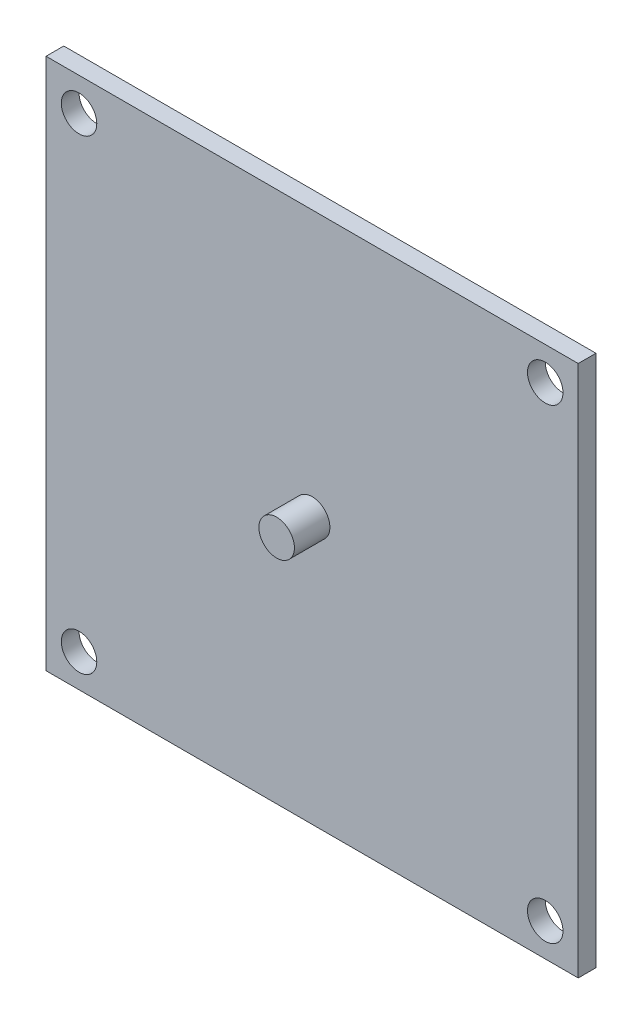
ISO-10303-21;
HEADER;
FILE_DESCRIPTION(('STEP AP214'),'2;1');
FILE_NAME('part.step','',(''),(''),'','','');
FILE_SCHEMA(('AUTOMOTIVE_DESIGN { 1 0 10303 214 1 1 1 1 }'));
ENDSEC;
DATA;
#1=APPLICATION_CONTEXT('core data for automotive mechanical design processes');
#2=APPLICATION_PROTOCOL_DEFINITION('international standard','automotive_design',2000,#1);
#3=PRODUCT_CONTEXT('',#1,'mechanical');
#4=PRODUCT('Part','Part','',(#3));
#5=PRODUCT_RELATED_PRODUCT_CATEGORY('part','',(#4));
#6=PRODUCT_DEFINITION_FORMATION('','',#4);
#7=PRODUCT_DEFINITION_CONTEXT('part definition',#1,'design');
#8=PRODUCT_DEFINITION('design','',#6,#7);
#9=PRODUCT_DEFINITION_SHAPE('','',#8);
#10=(LENGTH_UNIT() NAMED_UNIT(*) SI_UNIT(.MILLI.,.METRE.));
#11=(NAMED_UNIT(*) PLANE_ANGLE_UNIT() SI_UNIT($,.RADIAN.));
#12=(NAMED_UNIT(*) SI_UNIT($,.STERADIAN.) SOLID_ANGLE_UNIT());
#13=UNCERTAINTY_MEASURE_WITH_UNIT(LENGTH_MEASURE(1.E-05),#10,'distance_accuracy_value','');
#14=(GEOMETRIC_REPRESENTATION_CONTEXT(3) GLOBAL_UNCERTAINTY_ASSIGNED_CONTEXT((#13)) GLOBAL_UNIT_ASSIGNED_CONTEXT((#10,
#11,#12)) REPRESENTATION_CONTEXT('',''));
#15=CARTESIAN_POINT('',(0.,0.,0.));
#16=DIRECTION('',(0.,0.,1.));
#17=DIRECTION('',(1.,0.,0.));
#18=AXIS2_PLACEMENT_3D('',#15,#16,#17);
#19=CARTESIAN_POINT('',(15.,15.,1.));
#20=DIRECTION('',(-1.,0.,0.));
#21=DIRECTION('',(0.,-1.,0.));
#22=AXIS2_PLACEMENT_3D('',#19,#20,#21);
#23=PLANE('',#22);
#24=DIRECTION('',(0.,1.,0.));
#25=VECTOR('',#24,1.);
#26=CARTESIAN_POINT('',(15.,15.,0.));
#27=LINE('',#26,#25);
#28=CARTESIAN_POINT('',(15.,-15.,0.));
#29=VERTEX_POINT('',#28);
#30=CARTESIAN_POINT('',(15.,15.,0.));
#31=VERTEX_POINT('',#30);
#32=EDGE_CURVE('E95',#29,#31,#27,.T.);
#33=ORIENTED_EDGE('',*,*,#32,.T.);
#34=DIRECTION('',(0.,0.,-1.));
#35=VECTOR('',#34,1.);
#36=CARTESIAN_POINT('',(15.,15.,1.));
#37=LINE('',#36,#35);
#38=CARTESIAN_POINT('',(15.,15.,1.));
#39=VERTEX_POINT('',#38);
#40=EDGE_CURVE('E11',#39,#31,#37,.T.);
#41=ORIENTED_EDGE('',*,*,#40,.F.);
#42=DIRECTION('',(0.,1.,0.));
#43=VECTOR('',#42,1.);
#44=CARTESIAN_POINT('',(15.,15.,1.));
#45=LINE('',#44,#43);
#46=CARTESIAN_POINT('',(15.,-15.,1.));
#47=VERTEX_POINT('',#46);
#48=EDGE_CURVE('E83',#47,#39,#45,.T.);
#49=ORIENTED_EDGE('',*,*,#48,.F.);
#50=DIRECTION('',(0.,0.,-1.));
#51=VECTOR('',#50,1.);
#52=CARTESIAN_POINT('',(15.,-15.,1.));
#53=LINE('',#52,#51);
#54=EDGE_CURVE('E91',#47,#29,#53,.T.);
#55=ORIENTED_EDGE('',*,*,#54,.T.);
#56=EDGE_LOOP('',(#33,#41,#49,#55));
#57=FACE_BOUND('',#56,.T.);
#58=ADVANCED_FACE('F32',(#57),#23,.F.);
#59=CARTESIAN_POINT('',(-15.,15.,1.));
#60=DIRECTION('',(0.,-1.,0.));
#61=DIRECTION('',(0.,0.,-1.));
#62=AXIS2_PLACEMENT_3D('',#59,#60,#61);
#63=PLANE('',#62);
#64=DIRECTION('',(-1.,0.,0.));
#65=VECTOR('',#64,1.);
#66=CARTESIAN_POINT('',(-15.,15.,0.));
#67=LINE('',#66,#65);
#68=CARTESIAN_POINT('',(-15.,15.,0.));
#69=VERTEX_POINT('',#68);
#70=EDGE_CURVE('E87',#31,#69,#67,.T.);
#71=ORIENTED_EDGE('',*,*,#70,.T.);
#72=DIRECTION('',(0.,0.,-1.));
#73=VECTOR('',#72,1.);
#74=CARTESIAN_POINT('',(-15.,15.,1.));
#75=LINE('',#74,#73);
#76=CARTESIAN_POINT('',(-15.,15.,1.));
#77=VERTEX_POINT('',#76);
#78=EDGE_CURVE('E40',#77,#69,#75,.T.);
#79=ORIENTED_EDGE('',*,*,#78,.F.);
#80=DIRECTION('',(-1.,0.,0.));
#81=VECTOR('',#80,1.);
#82=CARTESIAN_POINT('',(-15.,15.,1.));
#83=LINE('',#82,#81);
#84=EDGE_CURVE('E78',#39,#77,#83,.T.);
#85=ORIENTED_EDGE('',*,*,#84,.F.);
#86=ORIENTED_EDGE('',*,*,#40,.T.);
#87=EDGE_LOOP('',(#71,#79,#85,#86));
#88=FACE_BOUND('',#87,.T.);
#89=ADVANCED_FACE('F86',(#88),#63,.F.);
#90=CARTESIAN_POINT('',(-15.,15.,1.));
#91=DIRECTION('',(1.,0.,0.));
#92=DIRECTION('',(0.,1.,0.));
#93=AXIS2_PLACEMENT_3D('',#90,#91,#92);
#94=PLANE('',#93);
#95=DIRECTION('',(0.,-1.,0.));
#96=VECTOR('',#95,1.);
#97=CARTESIAN_POINT('',(-15.,15.,0.));
#98=LINE('',#97,#96);
#99=CARTESIAN_POINT('',(-15.,-15.,0.));
#100=VERTEX_POINT('',#99);
#101=EDGE_CURVE('E65',#69,#100,#98,.T.);
#102=ORIENTED_EDGE('',*,*,#101,.T.);
#103=DIRECTION('',(0.,0.,-1.));
#104=VECTOR('',#103,1.);
#105=CARTESIAN_POINT('',(-15.,-15.,1.));
#106=LINE('',#105,#104);
#107=CARTESIAN_POINT('',(-15.,-15.,1.));
#108=VERTEX_POINT('',#107);
#109=EDGE_CURVE('E88',#108,#100,#106,.T.);
#110=ORIENTED_EDGE('',*,*,#109,.F.);
#111=DIRECTION('',(0.,-1.,0.));
#112=VECTOR('',#111,1.);
#113=CARTESIAN_POINT('',(-15.,15.,1.));
#114=LINE('',#113,#112);
#115=EDGE_CURVE('E81',#77,#108,#114,.T.);
#116=ORIENTED_EDGE('',*,*,#115,.F.);
#117=ORIENTED_EDGE('',*,*,#78,.T.);
#118=EDGE_LOOP('',(#102,#110,#116,#117));
#119=FACE_BOUND('',#118,.T.);
#120=ADVANCED_FACE('F89',(#119),#94,.F.);
#121=CARTESIAN_POINT('',(-15.,-15.,1.));
#122=DIRECTION('',(0.,1.,0.));
#123=DIRECTION('',(0.,0.,1.));
#124=AXIS2_PLACEMENT_3D('',#121,#122,#123);
#125=PLANE('',#124);
#126=DIRECTION('',(1.,0.,0.));
#127=VECTOR('',#126,1.);
#128=CARTESIAN_POINT('',(-15.,-15.,0.));
#129=LINE('',#128,#127);
#130=EDGE_CURVE('E71',#100,#29,#129,.T.);
#131=ORIENTED_EDGE('',*,*,#130,.T.);
#132=ORIENTED_EDGE('',*,*,#54,.F.);
#133=DIRECTION('',(1.,0.,0.));
#134=VECTOR('',#133,1.);
#135=CARTESIAN_POINT('',(-15.,-15.,1.));
#136=LINE('',#135,#134);
#137=EDGE_CURVE('E48',#108,#47,#136,.T.);
#138=ORIENTED_EDGE('',*,*,#137,.F.);
#139=ORIENTED_EDGE('',*,*,#109,.T.);
#140=EDGE_LOOP('',(#131,#132,#138,#139));
#141=FACE_BOUND('',#140,.T.);
#142=ADVANCED_FACE('F103',(#141),#125,.F.);
#143=CARTESIAN_POINT('',(0.,0.,1.));
#144=DIRECTION('',(0.,0.,1.));
#145=DIRECTION('',(1.,0.,0.));
#146=AXIS2_PLACEMENT_3D('',#143,#144,#145);
#147=PLANE('',#146);
#148=CARTESIAN_POINT('',(0.,0.,1.));
#149=DIRECTION('',(0.,0.,1.));
#150=DIRECTION('',(1.,0.,0.));
#151=AXIS2_PLACEMENT_3D('',#148,#149,#150);
#152=CIRCLE('',#151,1.);
#153=CARTESIAN_POINT('',(1.,0.,1.));
#154=VERTEX_POINT('',#153);
#155=EDGE_CURVE('E133',#154,#154,#152,.T.);
#156=ORIENTED_EDGE('',*,*,#155,.F.);
#157=EDGE_LOOP('',(#156));
#158=FACE_BOUND('',#157,.T.);
#159=CARTESIAN_POINT('',(-13.1399999999993,-13.14,1.));
#160=DIRECTION('',(0.,0.,1.));
#161=DIRECTION('',(1.,0.,0.));
#162=AXIS2_PLACEMENT_3D('',#159,#160,#161);
#163=CIRCLE('',#162,1.00000000000039);
#164=CARTESIAN_POINT('',(-12.1399999999989,-13.14,1.));
#165=VERTEX_POINT('',#164);
#166=EDGE_CURVE('E115',#165,#165,#163,.T.);
#167=ORIENTED_EDGE('',*,*,#166,.F.);
#168=EDGE_LOOP('',(#167));
#169=FACE_BOUND('',#168,.T.);
#170=CARTESIAN_POINT('',(13.1400000000007,-13.1399999999993,1.));
#171=DIRECTION('',(0.,0.,1.));
#172=DIRECTION('',(1.,0.,0.));
#173=AXIS2_PLACEMENT_3D('',#170,#171,#172);
#174=CIRCLE('',#173,1.00000000000104);
#175=CARTESIAN_POINT('',(14.1400000000018,-13.1399999999993,1.));
#176=VERTEX_POINT('',#175);
#177=EDGE_CURVE('E122',#176,#176,#174,.T.);
#178=ORIENTED_EDGE('',*,*,#177,.F.);
#179=EDGE_LOOP('',(#178));
#180=FACE_BOUND('',#179,.T.);
#181=CARTESIAN_POINT('',(13.14,13.1400000000007,1.));
#182=DIRECTION('',(0.,0.,1.));
#183=DIRECTION('',(1.,0.,0.));
#184=AXIS2_PLACEMENT_3D('',#181,#182,#183);
#185=CIRCLE('',#184,1.00000000000077);
#186=CARTESIAN_POINT('',(14.1400000000008,13.1400000000007,1.));
#187=VERTEX_POINT('',#186);
#188=EDGE_CURVE('E128',#187,#187,#185,.T.);
#189=ORIENTED_EDGE('',*,*,#188,.F.);
#190=EDGE_LOOP('',(#189));
#191=FACE_BOUND('',#190,.T.);
#192=CARTESIAN_POINT('',(-13.14,13.14,1.));
#193=DIRECTION('',(0.,0.,1.));
#194=DIRECTION('',(1.,0.,0.));
#195=AXIS2_PLACEMENT_3D('',#192,#193,#194);
#196=CIRCLE('',#195,1.);
#197=CARTESIAN_POINT('',(-12.14,13.14,1.));
#198=VERTEX_POINT('',#197);
#199=EDGE_CURVE('E109',#198,#198,#196,.T.);
#200=ORIENTED_EDGE('',*,*,#199,.F.);
#201=EDGE_LOOP('',(#200));
#202=FACE_BOUND('',#201,.T.);
#203=ORIENTED_EDGE('',*,*,#48,.T.);
#204=ORIENTED_EDGE('',*,*,#84,.T.);
#205=ORIENTED_EDGE('',*,*,#115,.T.);
#206=ORIENTED_EDGE('',*,*,#137,.T.);
#207=EDGE_LOOP('',(#203,#204,#205,#206));
#208=FACE_BOUND('',#207,.T.);
#209=ADVANCED_FACE('F79',(#158,#169,#180,#191,#202,#208),#147,.T.);
#210=CARTESIAN_POINT('',(0.,0.,0.));
#211=DIRECTION('',(0.,0.,1.));
#212=DIRECTION('',(1.,0.,0.));
#213=AXIS2_PLACEMENT_3D('',#210,#211,#212);
#214=PLANE('',#213);
#215=CARTESIAN_POINT('',(-13.1399999999993,-13.14,0.));
#216=DIRECTION('',(0.,0.,1.));
#217=DIRECTION('',(1.,0.,0.));
#218=AXIS2_PLACEMENT_3D('',#215,#216,#217);
#219=CIRCLE('',#218,1.00000000000039);
#220=CARTESIAN_POINT('',(-12.1399999999989,-13.14,0.));
#221=VERTEX_POINT('',#220);
#222=EDGE_CURVE('E118',#221,#221,#219,.T.);
#223=ORIENTED_EDGE('',*,*,#222,.T.);
#224=EDGE_LOOP('',(#223));
#225=FACE_BOUND('',#224,.T.);
#226=CARTESIAN_POINT('',(13.1400000000007,-13.1399999999993,0.));
#227=DIRECTION('',(0.,0.,1.));
#228=DIRECTION('',(1.,0.,0.));
#229=AXIS2_PLACEMENT_3D('',#226,#227,#228);
#230=CIRCLE('',#229,1.00000000000104);
#231=CARTESIAN_POINT('',(14.1400000000018,-13.1399999999993,0.));
#232=VERTEX_POINT('',#231);
#233=EDGE_CURVE('E125',#232,#232,#230,.T.);
#234=ORIENTED_EDGE('',*,*,#233,.T.);
#235=EDGE_LOOP('',(#234));
#236=FACE_BOUND('',#235,.T.);
#237=CARTESIAN_POINT('',(13.14,13.1400000000007,0.));
#238=DIRECTION('',(0.,0.,1.));
#239=DIRECTION('',(1.,0.,0.));
#240=AXIS2_PLACEMENT_3D('',#237,#238,#239);
#241=CIRCLE('',#240,1.00000000000077);
#242=CARTESIAN_POINT('',(14.1400000000008,13.1400000000007,0.));
#243=VERTEX_POINT('',#242);
#244=EDGE_CURVE('E112',#243,#243,#241,.T.);
#245=ORIENTED_EDGE('',*,*,#244,.T.);
#246=EDGE_LOOP('',(#245));
#247=FACE_BOUND('',#246,.T.);
#248=CARTESIAN_POINT('',(-13.14,13.14,0.));
#249=DIRECTION('',(0.,0.,1.));
#250=DIRECTION('',(1.,0.,0.));
#251=AXIS2_PLACEMENT_3D('',#248,#249,#250);
#252=CIRCLE('',#251,1.);
#253=CARTESIAN_POINT('',(-12.14,13.14,0.));
#254=VERTEX_POINT('',#253);
#255=EDGE_CURVE('E98',#254,#254,#252,.T.);
#256=ORIENTED_EDGE('',*,*,#255,.T.);
#257=EDGE_LOOP('',(#256));
#258=FACE_BOUND('',#257,.T.);
#259=ORIENTED_EDGE('',*,*,#32,.F.);
#260=ORIENTED_EDGE('',*,*,#130,.F.);
#261=ORIENTED_EDGE('',*,*,#101,.F.);
#262=ORIENTED_EDGE('',*,*,#70,.F.);
#263=EDGE_LOOP('',(#259,#260,#261,#262));
#264=FACE_BOUND('',#263,.T.);
#265=ADVANCED_FACE('F106',(#225,#236,#247,#258,#264),#214,.F.);
#266=CARTESIAN_POINT('',(-13.14,13.14,0.));
#267=DIRECTION('',(0.,0.,1.));
#268=DIRECTION('',(1.,0.,0.));
#269=AXIS2_PLACEMENT_3D('',#266,#267,#268);
#270=CYLINDRICAL_SURFACE('',#269,1.);
#271=ORIENTED_EDGE('',*,*,#255,.F.);
#272=EDGE_LOOP('',(#271));
#273=FACE_BOUND('',#272,.T.);
#274=ORIENTED_EDGE('',*,*,#199,.T.);
#275=EDGE_LOOP('',(#274));
#276=FACE_BOUND('',#275,.T.);
#277=ADVANCED_FACE('F159',(#273,#276),#270,.F.);
#278=CARTESIAN_POINT('',(13.14,13.1400000000007,0.));
#279=DIRECTION('',(0.,0.,1.));
#280=DIRECTION('',(1.,0.,0.));
#281=AXIS2_PLACEMENT_3D('',#278,#279,#280);
#282=CYLINDRICAL_SURFACE('',#281,1.00000000000077);
#283=ORIENTED_EDGE('',*,*,#244,.F.);
#284=EDGE_LOOP('',(#283));
#285=FACE_BOUND('',#284,.T.);
#286=ORIENTED_EDGE('',*,*,#188,.T.);
#287=EDGE_LOOP('',(#286));
#288=FACE_BOUND('',#287,.T.);
#289=ADVANCED_FACE('F161',(#285,#288),#282,.F.);
#290=CARTESIAN_POINT('',(13.1400000000007,-13.1399999999993,0.));
#291=DIRECTION('',(0.,0.,1.));
#292=DIRECTION('',(1.,0.,0.));
#293=AXIS2_PLACEMENT_3D('',#290,#291,#292);
#294=CYLINDRICAL_SURFACE('',#293,1.00000000000104);
#295=ORIENTED_EDGE('',*,*,#233,.F.);
#296=EDGE_LOOP('',(#295));
#297=FACE_BOUND('',#296,.T.);
#298=ORIENTED_EDGE('',*,*,#177,.T.);
#299=EDGE_LOOP('',(#298));
#300=FACE_BOUND('',#299,.T.);
#301=ADVANCED_FACE('F168',(#297,#300),#294,.F.);
#302=CARTESIAN_POINT('',(-13.1399999999993,-13.14,0.));
#303=DIRECTION('',(0.,0.,1.));
#304=DIRECTION('',(1.,0.,0.));
#305=AXIS2_PLACEMENT_3D('',#302,#303,#304);
#306=CYLINDRICAL_SURFACE('',#305,1.00000000000039);
#307=ORIENTED_EDGE('',*,*,#222,.F.);
#308=EDGE_LOOP('',(#307));
#309=FACE_BOUND('',#308,.T.);
#310=ORIENTED_EDGE('',*,*,#166,.T.);
#311=EDGE_LOOP('',(#310));
#312=FACE_BOUND('',#311,.T.);
#313=ADVANCED_FACE('F144',(#309,#312),#306,.F.);
#314=CARTESIAN_POINT('',(0.,0.,3.));
#315=DIRECTION('',(0.,0.,-1.));
#316=DIRECTION('',(-1.,0.,0.));
#317=AXIS2_PLACEMENT_3D('',#314,#315,#316);
#318=CYLINDRICAL_SURFACE('',#317,1.);
#319=CARTESIAN_POINT('',(0.,0.,3.));
#320=DIRECTION('',(0.,0.,1.));
#321=DIRECTION('',(1.,0.,0.));
#322=AXIS2_PLACEMENT_3D('',#319,#320,#321);
#323=CIRCLE('',#322,1.);
#324=CARTESIAN_POINT('',(1.,0.,3.));
#325=VERTEX_POINT('',#324);
#326=EDGE_CURVE('E119',#325,#325,#323,.T.);
#327=ORIENTED_EDGE('',*,*,#326,.F.);
#328=EDGE_LOOP('',(#327));
#329=FACE_BOUND('',#328,.T.);
#330=ORIENTED_EDGE('',*,*,#155,.T.);
#331=EDGE_LOOP('',(#330));
#332=FACE_BOUND('',#331,.T.);
#333=ADVANCED_FACE('F141',(#329,#332),#318,.T.);
#334=CARTESIAN_POINT('',(0.,0.,3.));
#335=DIRECTION('',(0.,0.,1.));
#336=DIRECTION('',(1.,0.,0.));
#337=AXIS2_PLACEMENT_3D('',#334,#335,#336);
#338=PLANE('',#337);
#339=ORIENTED_EDGE('',*,*,#326,.T.);
#340=EDGE_LOOP('',(#339));
#341=FACE_BOUND('',#340,.T.);
#342=ADVANCED_FACE('F139',(#341),#338,.T.);
#343=CLOSED_SHELL('',(#58,#89,#120,#142,#209,#265,#277,#289,#301,#313,#333,#342));
#344=MANIFOLD_SOLID_BREP('B2',#343);
#345=ADVANCED_BREP_SHAPE_REPRESENTATION('',(#18,#344),#14);
#346=SHAPE_DEFINITION_REPRESENTATION(#9,#345);
ENDSEC;
END-ISO-10303-21;
